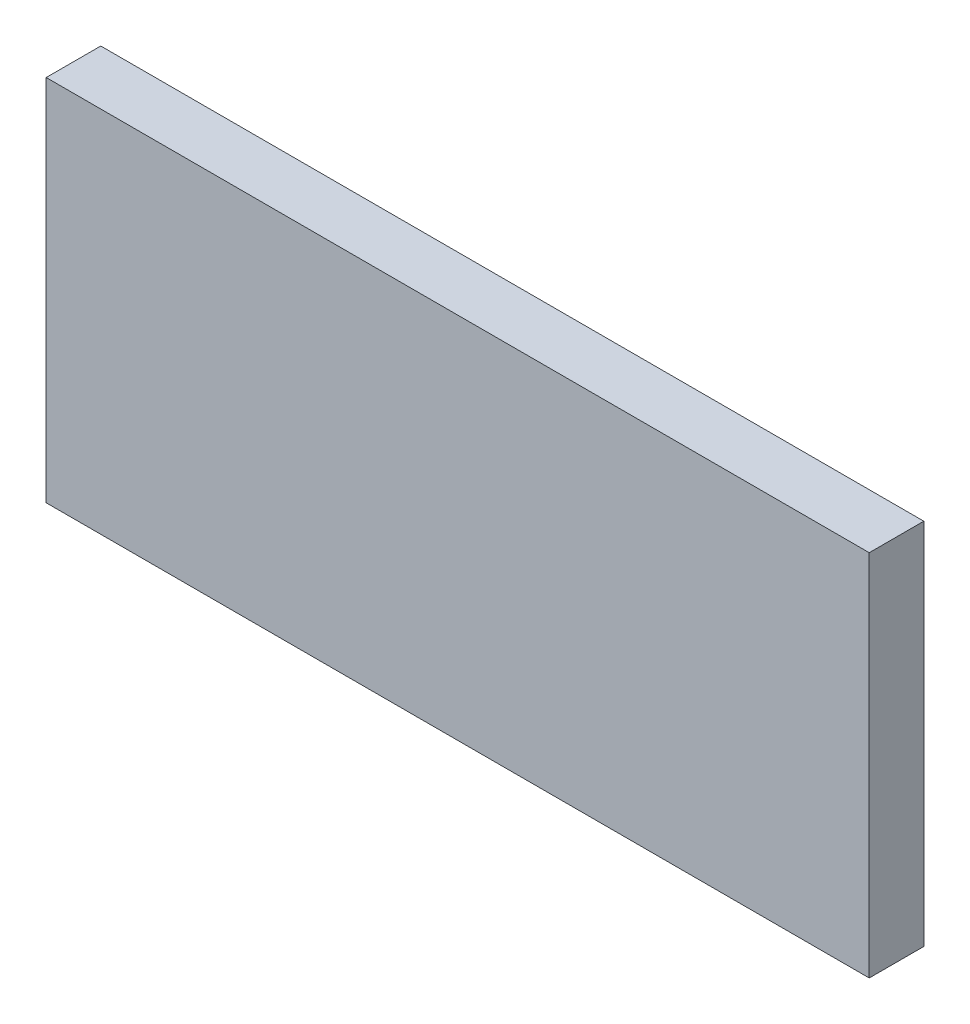
ISO-10303-21;
HEADER;
FILE_DESCRIPTION(('STEP AP214'),'2;1');
FILE_NAME('part.step','',(''),(''),'','','');
FILE_SCHEMA(('AUTOMOTIVE_DESIGN { 1 0 10303 214 1 1 1 1 }'));
ENDSEC;
DATA;
#1=APPLICATION_CONTEXT('core data for automotive mechanical design processes');
#2=APPLICATION_PROTOCOL_DEFINITION('international standard','automotive_design',2000,#1);
#3=PRODUCT_CONTEXT('',#1,'mechanical');
#4=PRODUCT('Part','Part','',(#3));
#5=PRODUCT_RELATED_PRODUCT_CATEGORY('part','',(#4));
#6=PRODUCT_DEFINITION_FORMATION('','',#4);
#7=PRODUCT_DEFINITION_CONTEXT('part definition',#1,'design');
#8=PRODUCT_DEFINITION('design','',#6,#7);
#9=PRODUCT_DEFINITION_SHAPE('','',#8);
#10=(LENGTH_UNIT() NAMED_UNIT(*) SI_UNIT(.MILLI.,.METRE.));
#11=(NAMED_UNIT(*) PLANE_ANGLE_UNIT() SI_UNIT($,.RADIAN.));
#12=(NAMED_UNIT(*) SI_UNIT($,.STERADIAN.) SOLID_ANGLE_UNIT());
#13=UNCERTAINTY_MEASURE_WITH_UNIT(LENGTH_MEASURE(1.E-05),#10,'distance_accuracy_value','');
#14=(GEOMETRIC_REPRESENTATION_CONTEXT(3) GLOBAL_UNCERTAINTY_ASSIGNED_CONTEXT((#13)) GLOBAL_UNIT_ASSIGNED_CONTEXT((#10,
#11,#12)) REPRESENTATION_CONTEXT('',''));
#15=CARTESIAN_POINT('',(0.,0.,0.));
#16=DIRECTION('',(0.,0.,1.));
#17=DIRECTION('',(1.,0.,0.));
#18=AXIS2_PLACEMENT_3D('',#15,#16,#17);
#19=CARTESIAN_POINT('',(-3.44805,1.54305,0.4572));
#20=DIRECTION('',(0.,0.,1.));
#21=DIRECTION('',(1.,0.,0.));
#22=AXIS2_PLACEMENT_3D('',#19,#20,#21);
#23=PLANE('',#22);
#24=DIRECTION('',(0.,1.,0.));
#25=VECTOR('',#24,1.);
#26=CARTESIAN_POINT('',(3.44805,1.54305,0.4572));
#27=LINE('',#26,#25);
#28=CARTESIAN_POINT('',(3.44805,1.54305,0.4572));
#29=VERTEX_POINT('',#28);
#30=CARTESIAN_POINT('',(3.44805,-1.54305,0.4572));
#31=VERTEX_POINT('',#30);
#32=EDGE_CURVE('E53',#29,#31,#27,.F.);
#33=ORIENTED_EDGE('',*,*,#32,.F.);
#34=DIRECTION('',(1.,0.,0.));
#35=VECTOR('',#34,1.);
#36=CARTESIAN_POINT('',(-3.44805,1.54305,0.4572));
#37=LINE('',#36,#35);
#38=CARTESIAN_POINT('',(-3.44805,1.54305,0.4572));
#39=VERTEX_POINT('',#38);
#40=EDGE_CURVE('E68',#39,#29,#37,.T.);
#41=ORIENTED_EDGE('',*,*,#40,.F.);
#42=DIRECTION('',(0.,1.,0.));
#43=VECTOR('',#42,1.);
#44=CARTESIAN_POINT('',(-3.44805,-1.54305,0.4572));
#45=LINE('',#44,#43);
#46=CARTESIAN_POINT('',(-3.44805,-1.54305,0.4572));
#47=VERTEX_POINT('',#46);
#48=EDGE_CURVE('E20',#47,#39,#45,.T.);
#49=ORIENTED_EDGE('',*,*,#48,.F.);
#50=DIRECTION('',(1.,0.,0.));
#51=VECTOR('',#50,1.);
#52=CARTESIAN_POINT('',(3.44805,-1.54305,0.4572));
#53=LINE('',#52,#51);
#54=EDGE_CURVE('E58',#31,#47,#53,.F.);
#55=ORIENTED_EDGE('',*,*,#54,.F.);
#56=EDGE_LOOP('',(#33,#41,#49,#55));
#57=FACE_BOUND('',#56,.T.);
#58=ADVANCED_FACE('F17',(#57),#23,.T.);
#59=CARTESIAN_POINT('',(-3.44805,-1.54305,0.));
#60=DIRECTION('',(-1.,0.,0.));
#61=DIRECTION('',(0.,0.,1.));
#62=AXIS2_PLACEMENT_3D('',#59,#60,#61);
#63=PLANE('',#62);
#64=DIRECTION('',(0.,0.,1.));
#65=VECTOR('',#64,1.);
#66=CARTESIAN_POINT('',(-3.44805,1.54305,0.));
#67=LINE('',#66,#65);
#68=CARTESIAN_POINT('',(-3.44805,1.54305,0.));
#69=VERTEX_POINT('',#68);
#70=EDGE_CURVE('E79',#69,#39,#67,.T.);
#71=ORIENTED_EDGE('',*,*,#70,.F.);
#72=DIRECTION('',(0.,1.,0.));
#73=VECTOR('',#72,1.);
#74=CARTESIAN_POINT('',(-3.44805,1.54305,0.));
#75=LINE('',#74,#73);
#76=CARTESIAN_POINT('',(-3.44805,-1.54305,0.));
#77=VERTEX_POINT('',#76);
#78=EDGE_CURVE('E74',#69,#77,#75,.F.);
#79=ORIENTED_EDGE('',*,*,#78,.T.);
#80=DIRECTION('',(0.,0.,-1.));
#81=VECTOR('',#80,1.);
#82=CARTESIAN_POINT('',(-3.44805,-1.54305,0.));
#83=LINE('',#82,#81);
#84=EDGE_CURVE('E63',#47,#77,#83,.T.);
#85=ORIENTED_EDGE('',*,*,#84,.F.);
#86=ORIENTED_EDGE('',*,*,#48,.T.);
#87=EDGE_LOOP('',(#71,#79,#85,#86));
#88=FACE_BOUND('',#87,.T.);
#89=ADVANCED_FACE('F73',(#88),#63,.T.);
#90=CARTESIAN_POINT('',(3.44805,-1.54305,0.));
#91=DIRECTION('',(0.,-1.,0.));
#92=DIRECTION('',(0.,0.,-1.));
#93=AXIS2_PLACEMENT_3D('',#90,#91,#92);
#94=PLANE('',#93);
#95=ORIENTED_EDGE('',*,*,#84,.T.);
#96=DIRECTION('',(1.,0.,0.));
#97=VECTOR('',#96,1.);
#98=CARTESIAN_POINT('',(-3.44805,-1.54305,0.));
#99=LINE('',#98,#97);
#100=CARTESIAN_POINT('',(3.44805,-1.54305,0.));
#101=VERTEX_POINT('',#100);
#102=EDGE_CURVE('E84',#77,#101,#99,.T.);
#103=ORIENTED_EDGE('',*,*,#102,.T.);
#104=DIRECTION('',(0.,0.,-1.));
#105=VECTOR('',#104,1.);
#106=CARTESIAN_POINT('',(3.44805,-1.54305,0.));
#107=LINE('',#106,#105);
#108=EDGE_CURVE('E65',#31,#101,#107,.T.);
#109=ORIENTED_EDGE('',*,*,#108,.F.);
#110=ORIENTED_EDGE('',*,*,#54,.T.);
#111=EDGE_LOOP('',(#95,#103,#109,#110));
#112=FACE_BOUND('',#111,.T.);
#113=ADVANCED_FACE('F60',(#112),#94,.T.);
#114=CARTESIAN_POINT('',(3.44805,1.54305,0.));
#115=DIRECTION('',(1.,0.,0.));
#116=DIRECTION('',(0.,0.,-1.));
#117=AXIS2_PLACEMENT_3D('',#114,#115,#116);
#118=PLANE('',#117);
#119=ORIENTED_EDGE('',*,*,#108,.T.);
#120=DIRECTION('',(0.,1.,0.));
#121=VECTOR('',#120,1.);
#122=CARTESIAN_POINT('',(3.44805,1.54305,0.));
#123=LINE('',#122,#121);
#124=CARTESIAN_POINT('',(3.44805,1.54305,0.));
#125=VERTEX_POINT('',#124);
#126=EDGE_CURVE('E26',#101,#125,#123,.T.);
#127=ORIENTED_EDGE('',*,*,#126,.T.);
#128=DIRECTION('',(0.,0.,1.));
#129=VECTOR('',#128,1.);
#130=CARTESIAN_POINT('',(3.44805,1.54305,0.));
#131=LINE('',#130,#129);
#132=EDGE_CURVE('E34',#29,#125,#131,.F.);
#133=ORIENTED_EDGE('',*,*,#132,.F.);
#134=ORIENTED_EDGE('',*,*,#32,.T.);
#135=EDGE_LOOP('',(#119,#127,#133,#134));
#136=FACE_BOUND('',#135,.T.);
#137=ADVANCED_FACE('F88',(#136),#118,.T.);
#138=CARTESIAN_POINT('',(-3.44805,1.54305,0.));
#139=DIRECTION('',(0.,1.,0.));
#140=DIRECTION('',(0.,0.,1.));
#141=AXIS2_PLACEMENT_3D('',#138,#139,#140);
#142=PLANE('',#141);
#143=ORIENTED_EDGE('',*,*,#132,.T.);
#144=DIRECTION('',(1.,0.,0.));
#145=VECTOR('',#144,1.);
#146=CARTESIAN_POINT('',(-3.44805,1.54305,0.));
#147=LINE('',#146,#145);
#148=EDGE_CURVE('E11',#125,#69,#147,.F.);
#149=ORIENTED_EDGE('',*,*,#148,.T.);
#150=ORIENTED_EDGE('',*,*,#70,.T.);
#151=ORIENTED_EDGE('',*,*,#40,.T.);
#152=EDGE_LOOP('',(#143,#149,#150,#151));
#153=FACE_BOUND('',#152,.T.);
#154=ADVANCED_FACE('F91',(#153),#142,.T.);
#155=CARTESIAN_POINT('',(-3.44805,1.54305,0.));
#156=DIRECTION('',(0.,0.,1.));
#157=DIRECTION('',(1.,0.,0.));
#158=AXIS2_PLACEMENT_3D('',#155,#156,#157);
#159=PLANE('',#158);
#160=ORIENTED_EDGE('',*,*,#126,.F.);
#161=ORIENTED_EDGE('',*,*,#102,.F.);
#162=ORIENTED_EDGE('',*,*,#78,.F.);
#163=ORIENTED_EDGE('',*,*,#148,.F.);
#164=EDGE_LOOP('',(#160,#161,#162,#163));
#165=FACE_BOUND('',#164,.T.);
#166=ADVANCED_FACE('F90',(#165),#159,.F.);
#167=CLOSED_SHELL('',(#58,#89,#113,#137,#154,#166));
#168=MANIFOLD_SOLID_BREP('B1',#167);
#169=ADVANCED_BREP_SHAPE_REPRESENTATION('',(#18,#168),#14);
#170=SHAPE_DEFINITION_REPRESENTATION(#9,#169);
ENDSEC;
END-ISO-10303-21;
